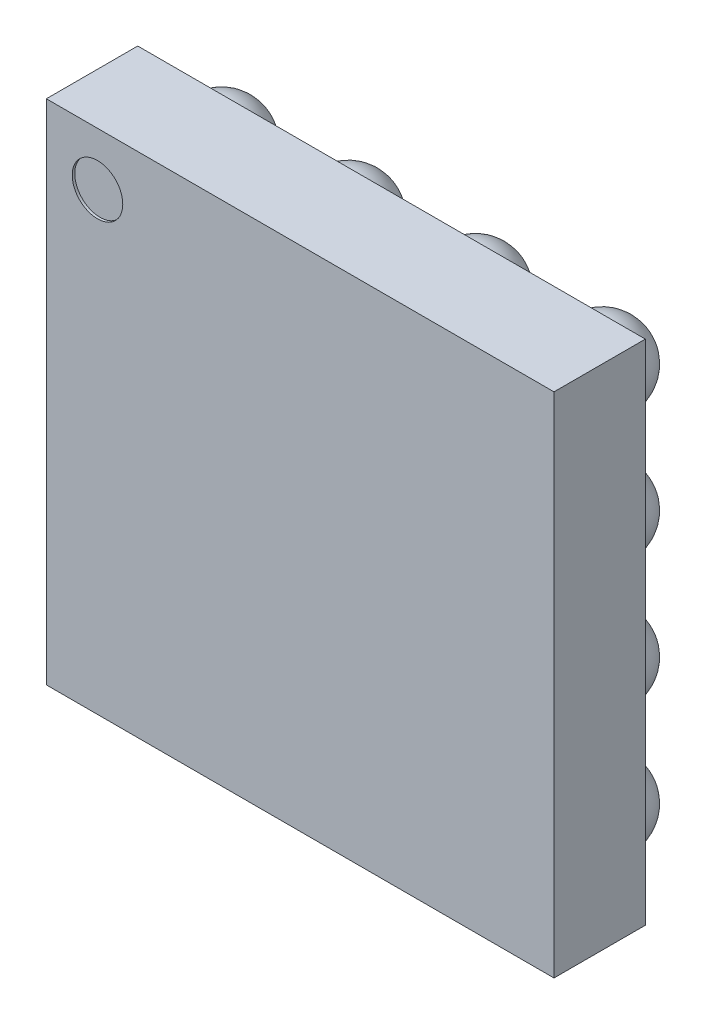
ISO-10303-21;
HEADER;
FILE_DESCRIPTION(('STEP AP214'),'2;1');
FILE_NAME('part.step','',(''),(''),'','','');
FILE_SCHEMA(('AUTOMOTIVE_DESIGN { 1 0 10303 214 1 1 1 1 }'));
ENDSEC;
DATA;
#1=APPLICATION_CONTEXT('core data for automotive mechanical design processes');
#2=APPLICATION_PROTOCOL_DEFINITION('international standard','automotive_design',2000,#1);
#3=PRODUCT_CONTEXT('',#1,'mechanical');
#4=PRODUCT('Part','Part','',(#3));
#5=PRODUCT_RELATED_PRODUCT_CATEGORY('part','',(#4));
#6=PRODUCT_DEFINITION_FORMATION('','',#4);
#7=PRODUCT_DEFINITION_CONTEXT('part definition',#1,'design');
#8=PRODUCT_DEFINITION('design','',#6,#7);
#9=PRODUCT_DEFINITION_SHAPE('','',#8);
#10=(LENGTH_UNIT() NAMED_UNIT(*) SI_UNIT(.MILLI.,.METRE.));
#11=(NAMED_UNIT(*) PLANE_ANGLE_UNIT() SI_UNIT($,.RADIAN.));
#12=(NAMED_UNIT(*) SI_UNIT($,.STERADIAN.) SOLID_ANGLE_UNIT());
#13=UNCERTAINTY_MEASURE_WITH_UNIT(LENGTH_MEASURE(1.E-05),#10,'distance_accuracy_value','');
#14=(GEOMETRIC_REPRESENTATION_CONTEXT(3) GLOBAL_UNCERTAINTY_ASSIGNED_CONTEXT((#13)) GLOBAL_UNIT_ASSIGNED_CONTEXT((#10,
#11,#12)) REPRESENTATION_CONTEXT('',''));
#15=CARTESIAN_POINT('',(0.,0.,0.));
#16=DIRECTION('',(0.,0.,1.));
#17=DIRECTION('',(1.,0.,0.));
#18=AXIS2_PLACEMENT_3D('',#15,#16,#17);
#19=CARTESIAN_POINT('',(1.,-1.,0.6));
#20=DIRECTION('',(-1.,0.,0.));
#21=DIRECTION('',(0.,0.,1.));
#22=AXIS2_PLACEMENT_3D('',#19,#20,#21);
#23=PLANE('',#22);
#24=DIRECTION('',(0.,1.,0.));
#25=VECTOR('',#24,1.);
#26=CARTESIAN_POINT('',(1.,-1.,0.24));
#27=LINE('',#26,#25);
#28=CARTESIAN_POINT('',(1.,-1.,0.24));
#29=VERTEX_POINT('',#28);
#30=CARTESIAN_POINT('',(1.,1.,0.24));
#31=VERTEX_POINT('',#30);
#32=EDGE_CURVE('E110',#29,#31,#27,.T.);
#33=ORIENTED_EDGE('',*,*,#32,.T.);
#34=DIRECTION('',(0.,0.,-1.));
#35=VECTOR('',#34,1.);
#36=CARTESIAN_POINT('',(1.,1.,0.6));
#37=LINE('',#36,#35);
#38=CARTESIAN_POINT('',(1.,1.,0.6));
#39=VERTEX_POINT('',#38);
#40=EDGE_CURVE('E101',#39,#31,#37,.T.);
#41=ORIENTED_EDGE('',*,*,#40,.F.);
#42=DIRECTION('',(0.,1.,0.));
#43=VECTOR('',#42,1.);
#44=CARTESIAN_POINT('',(1.,-1.,0.6));
#45=LINE('',#44,#43);
#46=CARTESIAN_POINT('',(1.,-1.,0.6));
#47=VERTEX_POINT('',#46);
#48=EDGE_CURVE('E95',#47,#39,#45,.T.);
#49=ORIENTED_EDGE('',*,*,#48,.F.);
#50=DIRECTION('',(0.,0.,-1.));
#51=VECTOR('',#50,1.);
#52=CARTESIAN_POINT('',(1.,-1.,0.6));
#53=LINE('',#52,#51);
#54=EDGE_CURVE('E106',#47,#29,#53,.T.);
#55=ORIENTED_EDGE('',*,*,#54,.T.);
#56=EDGE_LOOP('',(#33,#41,#49,#55));
#57=FACE_BOUND('',#56,.T.);
#58=ADVANCED_FACE('F43',(#57),#23,.F.);
#59=CARTESIAN_POINT('',(-1.,1.,0.6));
#60=DIRECTION('',(0.,-1.,0.));
#61=DIRECTION('',(0.,0.,-1.));
#62=AXIS2_PLACEMENT_3D('',#59,#60,#61);
#63=PLANE('',#62);
#64=DIRECTION('',(-1.,0.,0.));
#65=VECTOR('',#64,1.);
#66=CARTESIAN_POINT('',(-1.,1.,0.24));
#67=LINE('',#66,#65);
#68=CARTESIAN_POINT('',(-1.,1.,0.24));
#69=VERTEX_POINT('',#68);
#70=EDGE_CURVE('E100',#31,#69,#67,.T.);
#71=ORIENTED_EDGE('',*,*,#70,.T.);
#72=DIRECTION('',(0.,0.,-1.));
#73=VECTOR('',#72,1.);
#74=CARTESIAN_POINT('',(-1.,1.,0.6));
#75=LINE('',#74,#73);
#76=CARTESIAN_POINT('',(-1.,1.,0.6));
#77=VERTEX_POINT('',#76);
#78=EDGE_CURVE('E98',#77,#69,#75,.T.);
#79=ORIENTED_EDGE('',*,*,#78,.F.);
#80=DIRECTION('',(-1.,0.,0.));
#81=VECTOR('',#80,1.);
#82=CARTESIAN_POINT('',(-1.,1.,0.6));
#83=LINE('',#82,#81);
#84=EDGE_CURVE('E90',#39,#77,#83,.T.);
#85=ORIENTED_EDGE('',*,*,#84,.F.);
#86=ORIENTED_EDGE('',*,*,#40,.T.);
#87=EDGE_LOOP('',(#71,#79,#85,#86));
#88=FACE_BOUND('',#87,.T.);
#89=ADVANCED_FACE('F99',(#88),#63,.F.);
#90=CARTESIAN_POINT('',(-1.,-1.,0.6));
#91=DIRECTION('',(1.,0.,0.));
#92=DIRECTION('',(0.,0.,-1.));
#93=AXIS2_PLACEMENT_3D('',#90,#91,#92);
#94=PLANE('',#93);
#95=DIRECTION('',(0.,-1.,0.));
#96=VECTOR('',#95,1.);
#97=CARTESIAN_POINT('',(-1.,-1.,0.24));
#98=LINE('',#97,#96);
#99=CARTESIAN_POINT('',(-1.,-1.,0.24));
#100=VERTEX_POINT('',#99);
#101=EDGE_CURVE('E76',#69,#100,#98,.T.);
#102=ORIENTED_EDGE('',*,*,#101,.T.);
#103=DIRECTION('',(0.,0.,-1.));
#104=VECTOR('',#103,1.);
#105=CARTESIAN_POINT('',(-1.,-1.,0.6));
#106=LINE('',#105,#104);
#107=CARTESIAN_POINT('',(-1.,-1.,0.6));
#108=VERTEX_POINT('',#107);
#109=EDGE_CURVE('E102',#108,#100,#106,.T.);
#110=ORIENTED_EDGE('',*,*,#109,.F.);
#111=DIRECTION('',(0.,-1.,0.));
#112=VECTOR('',#111,1.);
#113=CARTESIAN_POINT('',(-1.,-1.,0.6));
#114=LINE('',#113,#112);
#115=EDGE_CURVE('E93',#77,#108,#114,.T.);
#116=ORIENTED_EDGE('',*,*,#115,.F.);
#117=ORIENTED_EDGE('',*,*,#78,.T.);
#118=EDGE_LOOP('',(#102,#110,#116,#117));
#119=FACE_BOUND('',#118,.T.);
#120=ADVANCED_FACE('F104',(#119),#94,.F.);
#121=CARTESIAN_POINT('',(-1.,-1.,0.6));
#122=DIRECTION('',(0.,1.,0.));
#123=DIRECTION('',(0.,0.,1.));
#124=AXIS2_PLACEMENT_3D('',#121,#122,#123);
#125=PLANE('',#124);
#126=DIRECTION('',(1.,0.,0.));
#127=VECTOR('',#126,1.);
#128=CARTESIAN_POINT('',(-1.,-1.,0.24));
#129=LINE('',#128,#127);
#130=EDGE_CURVE('E82',#100,#29,#129,.T.);
#131=ORIENTED_EDGE('',*,*,#130,.T.);
#132=ORIENTED_EDGE('',*,*,#54,.F.);
#133=DIRECTION('',(1.,0.,0.));
#134=VECTOR('',#133,1.);
#135=CARTESIAN_POINT('',(-1.,-1.,0.6));
#136=LINE('',#135,#134);
#137=EDGE_CURVE('E59',#108,#47,#136,.T.);
#138=ORIENTED_EDGE('',*,*,#137,.F.);
#139=ORIENTED_EDGE('',*,*,#109,.T.);
#140=EDGE_LOOP('',(#131,#132,#138,#139));
#141=FACE_BOUND('',#140,.T.);
#142=ADVANCED_FACE('F202',(#141),#125,.F.);
#143=CARTESIAN_POINT('',(0.,0.,0.6));
#144=DIRECTION('',(0.,0.,-1.));
#145=DIRECTION('',(-1.,0.,0.));
#146=AXIS2_PLACEMENT_3D('',#143,#144,#145);
#147=PLANE('',#146);
#148=CARTESIAN_POINT('',(-0.79855907840711,0.790600017824982,0.6));
#149=DIRECTION('',(0.,0.,1.));
#150=DIRECTION('',(1.,0.,0.));
#151=AXIS2_PLACEMENT_3D('',#148,#149,#150);
#152=CIRCLE('',#151,0.0995870999191673);
#153=CARTESIAN_POINT('',(-0.698971978487943,0.790600017824982,0.6));
#154=VERTEX_POINT('',#153);
#155=EDGE_CURVE('E490',#154,#154,#152,.T.);
#156=ORIENTED_EDGE('',*,*,#155,.F.);
#157=EDGE_LOOP('',(#156));
#158=FACE_BOUND('',#157,.T.);
#159=ORIENTED_EDGE('',*,*,#48,.T.);
#160=ORIENTED_EDGE('',*,*,#84,.T.);
#161=ORIENTED_EDGE('',*,*,#115,.T.);
#162=ORIENTED_EDGE('',*,*,#137,.T.);
#163=EDGE_LOOP('',(#159,#160,#161,#162));
#164=FACE_BOUND('',#163,.T.);
#165=ADVANCED_FACE('F91',(#158,#164),#147,.F.);
#166=CARTESIAN_POINT('',(0.,0.,0.24));
#167=DIRECTION('',(0.,0.,-1.));
#168=DIRECTION('',(-1.,0.,0.));
#169=AXIS2_PLACEMENT_3D('',#166,#167,#168);
#170=PLANE('',#169);
#171=CARTESIAN_POINT('',(-0.75,-0.75,0.24));
#172=DIRECTION('',(0.,0.,-1.));
#173=DIRECTION('',(-1.,0.,0.));
#174=AXIS2_PLACEMENT_3D('',#171,#172,#173);
#175=CIRCLE('',#174,0.13856406460551);
#176=CARTESIAN_POINT('',(-0.88856406460551,-0.75,0.24));
#177=VERTEX_POINT('',#176);
#178=EDGE_CURVE('E11',#177,#177,#175,.T.);
#179=ORIENTED_EDGE('',*,*,#178,.F.);
#180=EDGE_LOOP('',(#179));
#181=FACE_BOUND('',#180,.T.);
#182=CARTESIAN_POINT('',(-0.25,-0.75,0.24));
#183=DIRECTION('',(0.,0.,-1.));
#184=DIRECTION('',(-1.,0.,0.));
#185=AXIS2_PLACEMENT_3D('',#182,#183,#184);
#186=CIRCLE('',#185,0.13856406460551);
#187=CARTESIAN_POINT('',(-0.38856406460551,-0.75,0.24));
#188=VERTEX_POINT('',#187);
#189=EDGE_CURVE('E51',#188,#188,#186,.T.);
#190=ORIENTED_EDGE('',*,*,#189,.F.);
#191=EDGE_LOOP('',(#190));
#192=FACE_BOUND('',#191,.T.);
#193=CARTESIAN_POINT('',(0.25,-0.75,0.24));
#194=DIRECTION('',(0.,0.,-1.));
#195=DIRECTION('',(-1.,0.,0.));
#196=AXIS2_PLACEMENT_3D('',#193,#194,#195);
#197=CIRCLE('',#196,0.13856406460551);
#198=CARTESIAN_POINT('',(0.11143593539449,-0.75,0.24));
#199=VERTEX_POINT('',#198);
#200=EDGE_CURVE('E159',#199,#199,#197,.T.);
#201=ORIENTED_EDGE('',*,*,#200,.F.);
#202=EDGE_LOOP('',(#201));
#203=FACE_BOUND('',#202,.T.);
#204=CARTESIAN_POINT('',(0.75,-0.75,0.24));
#205=DIRECTION('',(0.,0.,-1.));
#206=DIRECTION('',(-1.,0.,0.));
#207=AXIS2_PLACEMENT_3D('',#204,#205,#206);
#208=CIRCLE('',#207,0.13856406460551);
#209=CARTESIAN_POINT('',(0.61143593539449,-0.75,0.24));
#210=VERTEX_POINT('',#209);
#211=EDGE_CURVE('E156',#210,#210,#208,.T.);
#212=ORIENTED_EDGE('',*,*,#211,.F.);
#213=EDGE_LOOP('',(#212));
#214=FACE_BOUND('',#213,.T.);
#215=CARTESIAN_POINT('',(-0.75,-0.25,0.24));
#216=DIRECTION('',(0.,0.,-1.));
#217=DIRECTION('',(-1.,0.,0.));
#218=AXIS2_PLACEMENT_3D('',#215,#216,#217);
#219=CIRCLE('',#218,0.13856406460551);
#220=CARTESIAN_POINT('',(-0.88856406460551,-0.25,0.24));
#221=VERTEX_POINT('',#220);
#222=EDGE_CURVE('E153',#221,#221,#219,.T.);
#223=ORIENTED_EDGE('',*,*,#222,.F.);
#224=EDGE_LOOP('',(#223));
#225=FACE_BOUND('',#224,.T.);
#226=CARTESIAN_POINT('',(-0.25,-0.25,0.24));
#227=DIRECTION('',(0.,0.,-1.));
#228=DIRECTION('',(-1.,0.,0.));
#229=AXIS2_PLACEMENT_3D('',#226,#227,#228);
#230=CIRCLE('',#229,0.13856406460551);
#231=CARTESIAN_POINT('',(-0.38856406460551,-0.25,0.24));
#232=VERTEX_POINT('',#231);
#233=EDGE_CURVE('E150',#232,#232,#230,.T.);
#234=ORIENTED_EDGE('',*,*,#233,.F.);
#235=EDGE_LOOP('',(#234));
#236=FACE_BOUND('',#235,.T.);
#237=CARTESIAN_POINT('',(0.25,-0.25,0.24));
#238=DIRECTION('',(0.,0.,-1.));
#239=DIRECTION('',(-1.,0.,0.));
#240=AXIS2_PLACEMENT_3D('',#237,#238,#239);
#241=CIRCLE('',#240,0.13856406460551);
#242=CARTESIAN_POINT('',(0.11143593539449,-0.25,0.24));
#243=VERTEX_POINT('',#242);
#244=EDGE_CURVE('E147',#243,#243,#241,.T.);
#245=ORIENTED_EDGE('',*,*,#244,.F.);
#246=EDGE_LOOP('',(#245));
#247=FACE_BOUND('',#246,.T.);
#248=CARTESIAN_POINT('',(0.75,-0.25,0.24));
#249=DIRECTION('',(0.,0.,-1.));
#250=DIRECTION('',(-1.,0.,0.));
#251=AXIS2_PLACEMENT_3D('',#248,#249,#250);
#252=CIRCLE('',#251,0.13856406460551);
#253=CARTESIAN_POINT('',(0.61143593539449,-0.25,0.24));
#254=VERTEX_POINT('',#253);
#255=EDGE_CURVE('E144',#254,#254,#252,.T.);
#256=ORIENTED_EDGE('',*,*,#255,.F.);
#257=EDGE_LOOP('',(#256));
#258=FACE_BOUND('',#257,.T.);
#259=CARTESIAN_POINT('',(-0.75,0.25,0.24));
#260=DIRECTION('',(0.,0.,-1.));
#261=DIRECTION('',(-1.,0.,0.));
#262=AXIS2_PLACEMENT_3D('',#259,#260,#261);
#263=CIRCLE('',#262,0.13856406460551);
#264=CARTESIAN_POINT('',(-0.88856406460551,0.25,0.24));
#265=VERTEX_POINT('',#264);
#266=EDGE_CURVE('E141',#265,#265,#263,.T.);
#267=ORIENTED_EDGE('',*,*,#266,.F.);
#268=EDGE_LOOP('',(#267));
#269=FACE_BOUND('',#268,.T.);
#270=CARTESIAN_POINT('',(-0.25,0.25,0.24));
#271=DIRECTION('',(0.,0.,-1.));
#272=DIRECTION('',(-1.,0.,0.));
#273=AXIS2_PLACEMENT_3D('',#270,#271,#272);
#274=CIRCLE('',#273,0.13856406460551);
#275=CARTESIAN_POINT('',(-0.38856406460551,0.25,0.24));
#276=VERTEX_POINT('',#275);
#277=EDGE_CURVE('E138',#276,#276,#274,.T.);
#278=ORIENTED_EDGE('',*,*,#277,.F.);
#279=EDGE_LOOP('',(#278));
#280=FACE_BOUND('',#279,.T.);
#281=CARTESIAN_POINT('',(0.25,0.25,0.24));
#282=DIRECTION('',(0.,0.,-1.));
#283=DIRECTION('',(-1.,0.,0.));
#284=AXIS2_PLACEMENT_3D('',#281,#282,#283);
#285=CIRCLE('',#284,0.13856406460551);
#286=CARTESIAN_POINT('',(0.11143593539449,0.25,0.24));
#287=VERTEX_POINT('',#286);
#288=EDGE_CURVE('E135',#287,#287,#285,.T.);
#289=ORIENTED_EDGE('',*,*,#288,.F.);
#290=EDGE_LOOP('',(#289));
#291=FACE_BOUND('',#290,.T.);
#292=CARTESIAN_POINT('',(0.75,0.25,0.24));
#293=DIRECTION('',(0.,0.,-1.));
#294=DIRECTION('',(-1.,0.,0.));
#295=AXIS2_PLACEMENT_3D('',#292,#293,#294);
#296=CIRCLE('',#295,0.13856406460551);
#297=CARTESIAN_POINT('',(0.61143593539449,0.25,0.24));
#298=VERTEX_POINT('',#297);
#299=EDGE_CURVE('E132',#298,#298,#296,.T.);
#300=ORIENTED_EDGE('',*,*,#299,.F.);
#301=EDGE_LOOP('',(#300));
#302=FACE_BOUND('',#301,.T.);
#303=CARTESIAN_POINT('',(-0.75,0.75,0.24));
#304=DIRECTION('',(0.,0.,-1.));
#305=DIRECTION('',(-1.,0.,0.));
#306=AXIS2_PLACEMENT_3D('',#303,#304,#305);
#307=CIRCLE('',#306,0.13856406460551);
#308=CARTESIAN_POINT('',(-0.88856406460551,0.75,0.24));
#309=VERTEX_POINT('',#308);
#310=EDGE_CURVE('E129',#309,#309,#307,.T.);
#311=ORIENTED_EDGE('',*,*,#310,.F.);
#312=EDGE_LOOP('',(#311));
#313=FACE_BOUND('',#312,.T.);
#314=CARTESIAN_POINT('',(-0.25,0.75,0.24));
#315=DIRECTION('',(0.,0.,-1.));
#316=DIRECTION('',(-1.,0.,0.));
#317=AXIS2_PLACEMENT_3D('',#314,#315,#316);
#318=CIRCLE('',#317,0.13856406460551);
#319=CARTESIAN_POINT('',(-0.38856406460551,0.75,0.24));
#320=VERTEX_POINT('',#319);
#321=EDGE_CURVE('E126',#320,#320,#318,.T.);
#322=ORIENTED_EDGE('',*,*,#321,.F.);
#323=EDGE_LOOP('',(#322));
#324=FACE_BOUND('',#323,.T.);
#325=CARTESIAN_POINT('',(0.25,0.75,0.24));
#326=DIRECTION('',(0.,0.,-1.));
#327=DIRECTION('',(-1.,0.,0.));
#328=AXIS2_PLACEMENT_3D('',#325,#326,#327);
#329=CIRCLE('',#328,0.13856406460551);
#330=CARTESIAN_POINT('',(0.11143593539449,0.75,0.24));
#331=VERTEX_POINT('',#330);
#332=EDGE_CURVE('E123',#331,#331,#329,.T.);
#333=ORIENTED_EDGE('',*,*,#332,.F.);
#334=EDGE_LOOP('',(#333));
#335=FACE_BOUND('',#334,.T.);
#336=CARTESIAN_POINT('',(0.75,0.75,0.24));
#337=DIRECTION('',(0.,0.,-1.));
#338=DIRECTION('',(-1.,0.,0.));
#339=AXIS2_PLACEMENT_3D('',#336,#337,#338);
#340=CIRCLE('',#339,0.13856406460551);
#341=CARTESIAN_POINT('',(0.61143593539449,0.75,0.24));
#342=VERTEX_POINT('',#341);
#343=EDGE_CURVE('E120',#342,#342,#340,.T.);
#344=ORIENTED_EDGE('',*,*,#343,.F.);
#345=EDGE_LOOP('',(#344));
#346=FACE_BOUND('',#345,.T.);
#347=ORIENTED_EDGE('',*,*,#32,.F.);
#348=ORIENTED_EDGE('',*,*,#130,.F.);
#349=ORIENTED_EDGE('',*,*,#101,.F.);
#350=ORIENTED_EDGE('',*,*,#70,.F.);
#351=EDGE_LOOP('',(#347,#348,#349,#350));
#352=FACE_BOUND('',#351,.T.);
#353=ADVANCED_FACE('F166',(#181,#192,#203,#214,#225,#236,#247,#258,#269,#280,#291,#302,#313,
#324,#335,#346,#352),#170,.T.);
#354=CARTESIAN_POINT('',(0.75,0.75,0.16));
#355=DIRECTION('',(0.,0.,1.));
#356=DIRECTION('',(0.,1.,0.));
#357=AXIS2_PLACEMENT_3D('',#354,#355,#356);
#358=SPHERICAL_SURFACE('',#357,0.16);
#359=ORIENTED_EDGE('',*,*,#343,.T.);
#360=EDGE_LOOP('',(#359));
#361=FACE_BOUND('',#360,.T.);
#362=ADVANCED_FACE('F169',(#361),#358,.T.);
#363=CARTESIAN_POINT('',(0.25,0.75,0.16));
#364=DIRECTION('',(0.,0.,1.));
#365=DIRECTION('',(0.,1.,0.));
#366=AXIS2_PLACEMENT_3D('',#363,#364,#365);
#367=SPHERICAL_SURFACE('',#366,0.16);
#368=ORIENTED_EDGE('',*,*,#332,.T.);
#369=EDGE_LOOP('',(#368));
#370=FACE_BOUND('',#369,.T.);
#371=ADVANCED_FACE('F238',(#370),#367,.T.);
#372=CARTESIAN_POINT('',(-0.25,0.75,0.16));
#373=DIRECTION('',(0.,0.,1.));
#374=DIRECTION('',(0.,1.,0.));
#375=AXIS2_PLACEMENT_3D('',#372,#373,#374);
#376=SPHERICAL_SURFACE('',#375,0.16);
#377=ORIENTED_EDGE('',*,*,#321,.T.);
#378=EDGE_LOOP('',(#377));
#379=FACE_BOUND('',#378,.T.);
#380=ADVANCED_FACE('F257',(#379),#376,.T.);
#381=CARTESIAN_POINT('',(-0.75,0.75,0.16));
#382=DIRECTION('',(0.,0.,1.));
#383=DIRECTION('',(0.,1.,0.));
#384=AXIS2_PLACEMENT_3D('',#381,#382,#383);
#385=SPHERICAL_SURFACE('',#384,0.16);
#386=ORIENTED_EDGE('',*,*,#310,.T.);
#387=EDGE_LOOP('',(#386));
#388=FACE_BOUND('',#387,.T.);
#389=ADVANCED_FACE('F269',(#388),#385,.T.);
#390=CARTESIAN_POINT('',(0.75,0.25,0.16));
#391=DIRECTION('',(0.,0.,1.));
#392=DIRECTION('',(0.,1.,0.));
#393=AXIS2_PLACEMENT_3D('',#390,#391,#392);
#394=SPHERICAL_SURFACE('',#393,0.16);
#395=ORIENTED_EDGE('',*,*,#299,.T.);
#396=EDGE_LOOP('',(#395));
#397=FACE_BOUND('',#396,.T.);
#398=ADVANCED_FACE('F281',(#397),#394,.T.);
#399=CARTESIAN_POINT('',(0.25,0.25,0.16));
#400=DIRECTION('',(0.,0.,1.));
#401=DIRECTION('',(0.,1.,0.));
#402=AXIS2_PLACEMENT_3D('',#399,#400,#401);
#403=SPHERICAL_SURFACE('',#402,0.16);
#404=ORIENTED_EDGE('',*,*,#288,.T.);
#405=EDGE_LOOP('',(#404));
#406=FACE_BOUND('',#405,.T.);
#407=ADVANCED_FACE('F293',(#406),#403,.T.);
#408=CARTESIAN_POINT('',(-0.25,0.25,0.16));
#409=DIRECTION('',(0.,0.,1.));
#410=DIRECTION('',(0.,1.,0.));
#411=AXIS2_PLACEMENT_3D('',#408,#409,#410);
#412=SPHERICAL_SURFACE('',#411,0.16);
#413=ORIENTED_EDGE('',*,*,#277,.T.);
#414=EDGE_LOOP('',(#413));
#415=FACE_BOUND('',#414,.T.);
#416=ADVANCED_FACE('F305',(#415),#412,.T.);
#417=CARTESIAN_POINT('',(-0.75,0.25,0.16));
#418=DIRECTION('',(0.,0.,1.));
#419=DIRECTION('',(0.,1.,0.));
#420=AXIS2_PLACEMENT_3D('',#417,#418,#419);
#421=SPHERICAL_SURFACE('',#420,0.16);
#422=ORIENTED_EDGE('',*,*,#266,.T.);
#423=EDGE_LOOP('',(#422));
#424=FACE_BOUND('',#423,.T.);
#425=ADVANCED_FACE('F317',(#424),#421,.T.);
#426=CARTESIAN_POINT('',(0.75,-0.25,0.16));
#427=DIRECTION('',(0.,0.,1.));
#428=DIRECTION('',(0.,1.,0.));
#429=AXIS2_PLACEMENT_3D('',#426,#427,#428);
#430=SPHERICAL_SURFACE('',#429,0.16);
#431=ORIENTED_EDGE('',*,*,#255,.T.);
#432=EDGE_LOOP('',(#431));
#433=FACE_BOUND('',#432,.T.);
#434=ADVANCED_FACE('F329',(#433),#430,.T.);
#435=CARTESIAN_POINT('',(0.25,-0.25,0.16));
#436=DIRECTION('',(0.,0.,1.));
#437=DIRECTION('',(0.,1.,0.));
#438=AXIS2_PLACEMENT_3D('',#435,#436,#437);
#439=SPHERICAL_SURFACE('',#438,0.16);
#440=ORIENTED_EDGE('',*,*,#244,.T.);
#441=EDGE_LOOP('',(#440));
#442=FACE_BOUND('',#441,.T.);
#443=ADVANCED_FACE('F341',(#442),#439,.T.);
#444=CARTESIAN_POINT('',(-0.25,-0.25,0.16));
#445=DIRECTION('',(0.,0.,1.));
#446=DIRECTION('',(0.,1.,0.));
#447=AXIS2_PLACEMENT_3D('',#444,#445,#446);
#448=SPHERICAL_SURFACE('',#447,0.16);
#449=ORIENTED_EDGE('',*,*,#233,.T.);
#450=EDGE_LOOP('',(#449));
#451=FACE_BOUND('',#450,.T.);
#452=ADVANCED_FACE('F353',(#451),#448,.T.);
#453=CARTESIAN_POINT('',(-0.75,-0.25,0.16));
#454=DIRECTION('',(0.,0.,1.));
#455=DIRECTION('',(0.,1.,0.));
#456=AXIS2_PLACEMENT_3D('',#453,#454,#455);
#457=SPHERICAL_SURFACE('',#456,0.16);
#458=ORIENTED_EDGE('',*,*,#222,.T.);
#459=EDGE_LOOP('',(#458));
#460=FACE_BOUND('',#459,.T.);
#461=ADVANCED_FACE('F365',(#460),#457,.T.);
#462=CARTESIAN_POINT('',(0.75,-0.75,0.16));
#463=DIRECTION('',(0.,0.,1.));
#464=DIRECTION('',(0.,1.,0.));
#465=AXIS2_PLACEMENT_3D('',#462,#463,#464);
#466=SPHERICAL_SURFACE('',#465,0.16);
#467=ORIENTED_EDGE('',*,*,#211,.T.);
#468=EDGE_LOOP('',(#467));
#469=FACE_BOUND('',#468,.T.);
#470=ADVANCED_FACE('F377',(#469),#466,.T.);
#471=CARTESIAN_POINT('',(0.25,-0.75,0.16));
#472=DIRECTION('',(0.,0.,1.));
#473=DIRECTION('',(0.,1.,0.));
#474=AXIS2_PLACEMENT_3D('',#471,#472,#473);
#475=SPHERICAL_SURFACE('',#474,0.16);
#476=ORIENTED_EDGE('',*,*,#200,.T.);
#477=EDGE_LOOP('',(#476));
#478=FACE_BOUND('',#477,.T.);
#479=ADVANCED_FACE('F389',(#478),#475,.T.);
#480=CARTESIAN_POINT('',(-0.25,-0.75,0.16));
#481=DIRECTION('',(0.,0.,1.));
#482=DIRECTION('',(0.,1.,0.));
#483=AXIS2_PLACEMENT_3D('',#480,#481,#482);
#484=SPHERICAL_SURFACE('',#483,0.16);
#485=ORIENTED_EDGE('',*,*,#189,.T.);
#486=EDGE_LOOP('',(#485));
#487=FACE_BOUND('',#486,.T.);
#488=ADVANCED_FACE('F164',(#487),#484,.T.);
#489=CARTESIAN_POINT('',(-0.75,-0.75,0.16));
#490=DIRECTION('',(0.,0.,1.));
#491=DIRECTION('',(0.,1.,0.));
#492=AXIS2_PLACEMENT_3D('',#489,#490,#491);
#493=SPHERICAL_SURFACE('',#492,0.16);
#494=ORIENTED_EDGE('',*,*,#178,.T.);
#495=EDGE_LOOP('',(#494));
#496=FACE_BOUND('',#495,.T.);
#497=ADVANCED_FACE('F412',(#496),#493,.T.);
#498=CARTESIAN_POINT('',(-0.79855907840711,0.790600017824982,0.59));
#499=DIRECTION('',(0.,0.,1.));
#500=DIRECTION('',(1.,0.,0.));
#501=AXIS2_PLACEMENT_3D('',#498,#499,#500);
#502=CYLINDRICAL_SURFACE('',#501,0.0995870999191673);
#503=CARTESIAN_POINT('',(-0.79855907840711,0.790600017824982,0.59));
#504=DIRECTION('',(0.,0.,1.));
#505=DIRECTION('',(1.,0.,0.));
#506=AXIS2_PLACEMENT_3D('',#503,#504,#505);
#507=CIRCLE('',#506,0.0995870999191673);
#508=CARTESIAN_POINT('',(-0.698971978487943,0.790600017824982,0.59));
#509=VERTEX_POINT('',#508);
#510=EDGE_CURVE('E113',#509,#509,#507,.T.);
#511=ORIENTED_EDGE('',*,*,#510,.F.);
#512=EDGE_LOOP('',(#511));
#513=FACE_BOUND('',#512,.T.);
#514=ORIENTED_EDGE('',*,*,#155,.T.);
#515=EDGE_LOOP('',(#514));
#516=FACE_BOUND('',#515,.T.);
#517=ADVANCED_FACE('F423',(#513,#516),#502,.F.);
#518=CARTESIAN_POINT('',(-0.79855907840711,0.790600017824982,0.59));
#519=DIRECTION('',(0.,0.,1.));
#520=DIRECTION('',(1.,0.,0.));
#521=AXIS2_PLACEMENT_3D('',#518,#519,#520);
#522=PLANE('',#521);
#523=ORIENTED_EDGE('',*,*,#510,.T.);
#524=EDGE_LOOP('',(#523));
#525=FACE_BOUND('',#524,.T.);
#526=ADVANCED_FACE('F440',(#525),#522,.T.);
#527=CLOSED_SHELL('',(#58,#89,#120,#142,#165,#353,#362,#371,#380,#389,#398,#407,#416,#425,#434,
#443,#452,#461,#470,#479,#488,#497,#517,#526));
#528=MANIFOLD_SOLID_BREP('B2',#527);
#529=ADVANCED_BREP_SHAPE_REPRESENTATION('',(#18,#528),#14);
#530=SHAPE_DEFINITION_REPRESENTATION(#9,#529);
ENDSEC;
END-ISO-10303-21;
